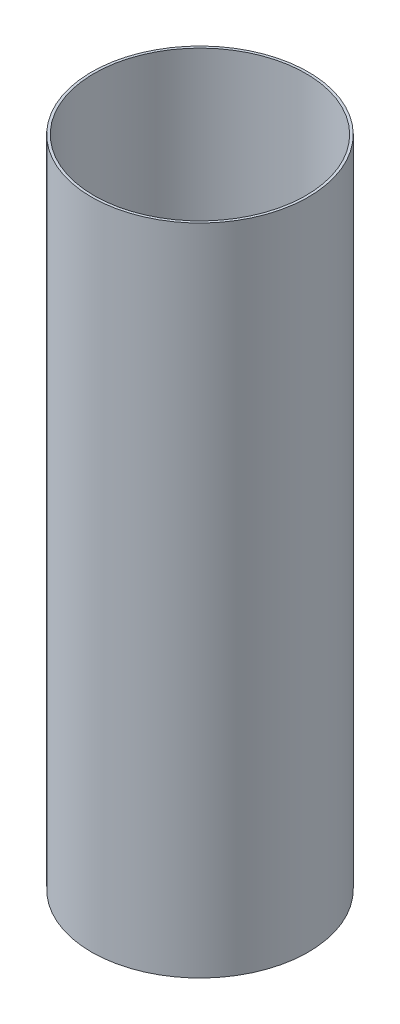
ISO-10303-21;
HEADER;
FILE_DESCRIPTION(('STEP AP214'),'2;1');
FILE_NAME('part.step','',(''),(''),'','','');
FILE_SCHEMA(('AUTOMOTIVE_DESIGN { 1 0 10303 214 1 1 1 1 }'));
ENDSEC;
DATA;
#1=APPLICATION_CONTEXT('core data for automotive mechanical design processes');
#2=APPLICATION_PROTOCOL_DEFINITION('international standard','automotive_design',2000,#1);
#3=PRODUCT_CONTEXT('',#1,'mechanical');
#4=PRODUCT('Part','Part','',(#3));
#5=PRODUCT_RELATED_PRODUCT_CATEGORY('part','',(#4));
#6=PRODUCT_DEFINITION_FORMATION('','',#4);
#7=PRODUCT_DEFINITION_CONTEXT('part definition',#1,'design');
#8=PRODUCT_DEFINITION('design','',#6,#7);
#9=PRODUCT_DEFINITION_SHAPE('','',#8);
#10=(LENGTH_UNIT() NAMED_UNIT(*) SI_UNIT(.MILLI.,.METRE.));
#11=(NAMED_UNIT(*) PLANE_ANGLE_UNIT() SI_UNIT($,.RADIAN.));
#12=(NAMED_UNIT(*) SI_UNIT($,.STERADIAN.) SOLID_ANGLE_UNIT());
#13=UNCERTAINTY_MEASURE_WITH_UNIT(LENGTH_MEASURE(1.E-05),#10,'distance_accuracy_value','');
#14=(GEOMETRIC_REPRESENTATION_CONTEXT(3) GLOBAL_UNCERTAINTY_ASSIGNED_CONTEXT((#13)) GLOBAL_UNIT_ASSIGNED_CONTEXT((#10,
#11,#12)) REPRESENTATION_CONTEXT('',''));
#15=CARTESIAN_POINT('',(0.,0.,0.));
#16=DIRECTION('',(0.,0.,1.));
#17=DIRECTION('',(1.,0.,0.));
#18=AXIS2_PLACEMENT_3D('',#15,#16,#17);
#19=CARTESIAN_POINT('',(0.,100.,0.));
#20=DIRECTION('',(0.,1.,0.));
#21=DIRECTION('',(0.,0.,1.));
#22=AXIS2_PLACEMENT_3D('',#19,#20,#21);
#23=PLANE('',#22);
#24=CARTESIAN_POINT('',(0.,100.,0.));
#25=DIRECTION('',(0.,1.,0.));
#26=DIRECTION('',(0.,0.,1.));
#27=AXIS2_PLACEMENT_3D('',#24,#25,#26);
#28=CIRCLE('',#27,33.16);
#29=CARTESIAN_POINT('',(0.,100.,33.16));
#30=VERTEX_POINT('',#29);
#31=EDGE_CURVE('E10',#30,#30,#28,.T.);
#32=ORIENTED_EDGE('',*,*,#31,.T.);
#33=EDGE_LOOP('',(#32));
#34=FACE_BOUND('',#33,.T.);
#35=CARTESIAN_POINT('',(0.,100.,0.));
#36=DIRECTION('',(0.,1.,0.));
#37=DIRECTION('',(0.,0.,1.));
#38=AXIS2_PLACEMENT_3D('',#35,#36,#37);
#39=CIRCLE('',#38,32.385);
#40=CARTESIAN_POINT('',(0.,100.,32.385));
#41=VERTEX_POINT('',#40);
#42=EDGE_CURVE('E41',#41,#41,#39,.T.);
#43=ORIENTED_EDGE('',*,*,#42,.F.);
#44=EDGE_LOOP('',(#43));
#45=FACE_BOUND('',#44,.T.);
#46=ADVANCED_FACE('F30',(#34,#45),#23,.T.);
#47=CARTESIAN_POINT('',(0.,-100.,0.));
#48=DIRECTION('',(0.,1.,0.));
#49=DIRECTION('',(0.,0.,1.));
#50=AXIS2_PLACEMENT_3D('',#47,#48,#49);
#51=PLANE('',#50);
#52=CARTESIAN_POINT('',(0.,-100.,0.));
#53=DIRECTION('',(0.,1.,0.));
#54=DIRECTION('',(0.,0.,1.));
#55=AXIS2_PLACEMENT_3D('',#52,#53,#54);
#56=CIRCLE('',#55,33.16);
#57=CARTESIAN_POINT('',(0.,-100.,33.16));
#58=VERTEX_POINT('',#57);
#59=EDGE_CURVE('E34',#58,#58,#56,.T.);
#60=ORIENTED_EDGE('',*,*,#59,.F.);
#61=EDGE_LOOP('',(#60));
#62=FACE_BOUND('',#61,.T.);
#63=CARTESIAN_POINT('',(0.,-100.,0.));
#64=DIRECTION('',(0.,1.,0.));
#65=DIRECTION('',(0.,0.,1.));
#66=AXIS2_PLACEMENT_3D('',#63,#64,#65);
#67=CIRCLE('',#66,32.385);
#68=CARTESIAN_POINT('',(0.,-100.,32.385));
#69=VERTEX_POINT('',#68);
#70=EDGE_CURVE('E43',#69,#69,#67,.T.);
#71=ORIENTED_EDGE('',*,*,#70,.T.);
#72=EDGE_LOOP('',(#71));
#73=FACE_BOUND('',#72,.T.);
#74=ADVANCED_FACE('F53',(#62,#73),#51,.F.);
#75=CARTESIAN_POINT('',(0.,100.,0.));
#76=DIRECTION('',(0.,-1.,0.));
#77=DIRECTION('',(0.,0.,-1.));
#78=AXIS2_PLACEMENT_3D('',#75,#76,#77);
#79=CYLINDRICAL_SURFACE('',#78,33.16);
#80=ORIENTED_EDGE('',*,*,#31,.F.);
#81=EDGE_LOOP('',(#80));
#82=FACE_BOUND('',#81,.T.);
#83=ORIENTED_EDGE('',*,*,#59,.T.);
#84=EDGE_LOOP('',(#83));
#85=FACE_BOUND('',#84,.T.);
#86=ADVANCED_FACE('F32',(#82,#85),#79,.T.);
#87=CARTESIAN_POINT('',(0.,100.,0.));
#88=DIRECTION('',(0.,-1.,0.));
#89=DIRECTION('',(0.,0.,-1.));
#90=AXIS2_PLACEMENT_3D('',#87,#88,#89);
#91=CYLINDRICAL_SURFACE('',#90,32.385);
#92=ORIENTED_EDGE('',*,*,#42,.T.);
#93=EDGE_LOOP('',(#92));
#94=FACE_BOUND('',#93,.T.);
#95=ORIENTED_EDGE('',*,*,#70,.F.);
#96=EDGE_LOOP('',(#95));
#97=FACE_BOUND('',#96,.T.);
#98=ADVANCED_FACE('F49',(#94,#97),#91,.F.);
#99=CLOSED_SHELL('',(#46,#74,#86,#98));
#100=MANIFOLD_SOLID_BREP('B2',#99);
#101=ADVANCED_BREP_SHAPE_REPRESENTATION('',(#18,#100),#14);
#102=SHAPE_DEFINITION_REPRESENTATION(#9,#101);
ENDSEC;
END-ISO-10303-21;
